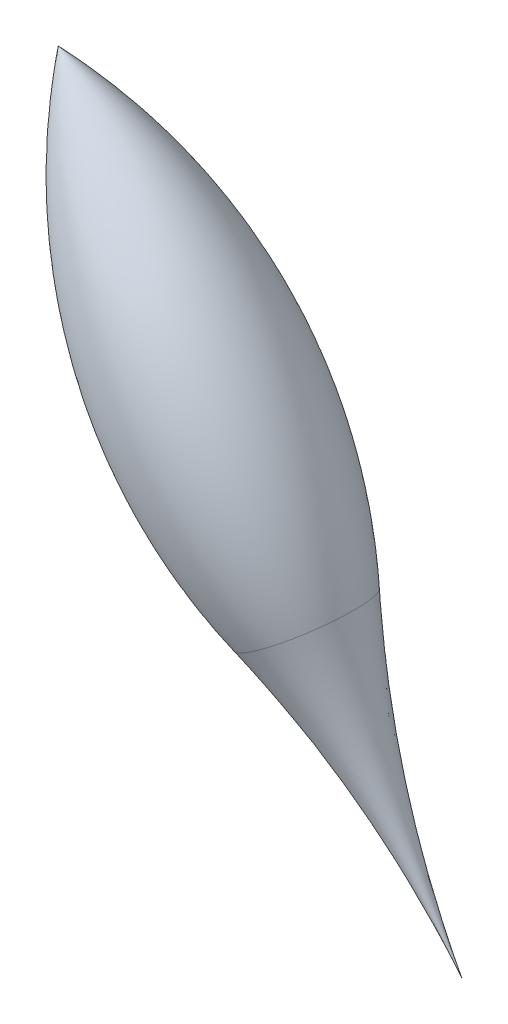
ISO-10303-21;
HEADER;
FILE_DESCRIPTION(('STEP AP214'),'2;1');
FILE_NAME('part.step','',(''),(''),'','','');
FILE_SCHEMA(('AUTOMOTIVE_DESIGN { 1 0 10303 214 1 1 1 1 }'));
ENDSEC;
DATA;
#1=APPLICATION_CONTEXT('core data for automotive mechanical design processes');
#2=APPLICATION_PROTOCOL_DEFINITION('international standard','automotive_design',2000,#1);
#3=PRODUCT_CONTEXT('',#1,'mechanical');
#4=PRODUCT('Part','Part','',(#3));
#5=PRODUCT_RELATED_PRODUCT_CATEGORY('part','',(#4));
#6=PRODUCT_DEFINITION_FORMATION('','',#4);
#7=PRODUCT_DEFINITION_CONTEXT('part definition',#1,'design');
#8=PRODUCT_DEFINITION('design','',#6,#7);
#9=PRODUCT_DEFINITION_SHAPE('','',#8);
#10=(LENGTH_UNIT() NAMED_UNIT(*) SI_UNIT(.MILLI.,.METRE.));
#11=(NAMED_UNIT(*) PLANE_ANGLE_UNIT() SI_UNIT($,.RADIAN.));
#12=(NAMED_UNIT(*) SI_UNIT($,.STERADIAN.) SOLID_ANGLE_UNIT());
#13=UNCERTAINTY_MEASURE_WITH_UNIT(LENGTH_MEASURE(1.E-05),#10,'distance_accuracy_value','');
#14=(GEOMETRIC_REPRESENTATION_CONTEXT(3) GLOBAL_UNCERTAINTY_ASSIGNED_CONTEXT((#13)) GLOBAL_UNIT_ASSIGNED_CONTEXT((#10,
#11,#12)) REPRESENTATION_CONTEXT('',''));
#15=CARTESIAN_POINT('',(0.,0.,0.));
#16=DIRECTION('',(0.,0.,1.));
#17=DIRECTION('',(1.,0.,0.));
#18=AXIS2_PLACEMENT_3D('',#15,#16,#17);
#19=CARTESIAN_POINT('',(75.,75.,0.));
#20=DIRECTION('',(0.,0.,-1.));
#21=DIRECTION('',(-0.832050294337844,-0.554700196225229,0.));
#22=AXIS2_PLACEMENT_3D('',#19,#20,#21);
#23=CIRCLE('',#22,125.);
#24=TRIMMED_CURVE('',#23,(PARAMETER_VALUE(-0.588002603547568)),
(PARAMETER_VALUE(0.588002603547568)),.T.,.PARAMETER.);
#25=CARTESIAN_POINT('',(-11.5384615384616,17.3076923076923,0.));
#26=DIRECTION('',(-0.554700196225229,0.832050294337844,0.));
#27=AXIS1_PLACEMENT('',#25,#26);
#28=SURFACE_OF_REVOLUTION('',#24,#27);
#29=CARTESIAN_POINT('',(11.5384615384615,-17.3076923076923,0.));
#30=DIRECTION('',(-0.554700196225229,0.832050294337844,0.));
#31=DIRECTION('',(-0.832050294337844,-0.554700196225229,0.));
#32=AXIS2_PLACEMENT_3D('',#29,#30,#31);
#33=CIRCLE('',#32,13.8675049056307);
#34=CARTESIAN_POINT('',(0.,-25.,0.));
#35=VERTEX_POINT('',#34);
#36=EDGE_CURVE('E11',#35,#35,#33,.T.);
#37=ORIENTED_EDGE('',*,*,#36,.T.);
#38=EDGE_LOOP('',(#37));
#39=FACE_BOUND('',#38,.T.);
#40=CARTESIAN_POINT('',(-50.,75.,0.));
#41=VERTEX_POINT('',#40);
#42=VERTEX_LOOP('',#41);
#43=FACE_BOUND('',#42,.T.);
#44=ADVANCED_FACE('F35',(#39,#43),#28,.T.);
#45=CARTESIAN_POINT('',(-149.999999999998,-224.999999999998,0.));
#46=DIRECTION('',(0.,0.,-1.));
#47=DIRECTION('',(-0.832050294337844,-0.554700196225229,0.));
#48=AXIS2_PLACEMENT_3D('',#45,#46,#47);
#49=CIRCLE('',#48,249.999999999997);
#50=TRIMMED_CURVE('',#49,(PARAMETER_VALUE(-3.08609414834408)),
(PARAMETER_VALUE(3.08609414834408)),.T.,.PARAMETER.);
#51=CARTESIAN_POINT('',(57.6923076923074,-86.5384615384611,0.));
#52=DIRECTION('',(-0.554700196225229,0.832050294337844,0.));
#53=AXIS1_PLACEMENT('',#51,#52);
#54=SURFACE_OF_REVOLUTION('',#50,#53);
#55=CARTESIAN_POINT('',(50.,-74.9999999999999,0.));
#56=VERTEX_POINT('',#55);
#57=VERTEX_LOOP('',#56);
#58=FACE_BOUND('',#57,.T.);
#59=ORIENTED_EDGE('',*,*,#36,.F.);
#60=EDGE_LOOP('',(#59));
#61=FACE_BOUND('',#60,.T.);
#62=ADVANCED_FACE('F46',(#58,#61),#54,.F.);
#63=CLOSED_SHELL('',(#44,#62));
#64=MANIFOLD_SOLID_BREP('B2',#63);
#65=ADVANCED_BREP_SHAPE_REPRESENTATION('',(#18,#64),#14);
#66=SHAPE_DEFINITION_REPRESENTATION(#9,#65);
ENDSEC;
END-ISO-10303-21;
